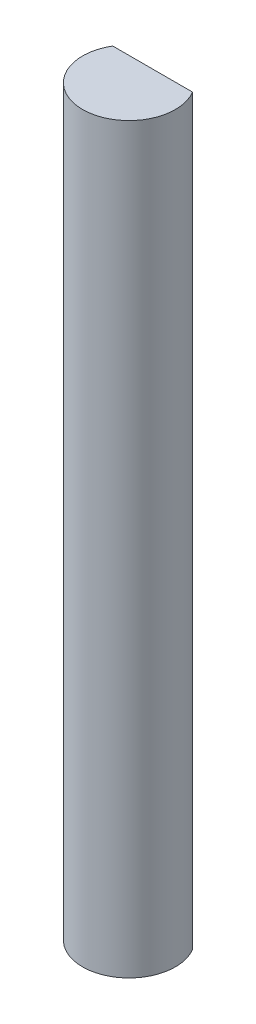
ISO-10303-21;
HEADER;
FILE_DESCRIPTION(('STEP AP214'),'2;1');
FILE_NAME('part.step','',(''),(''),'','','');
FILE_SCHEMA(('AUTOMOTIVE_DESIGN { 1 0 10303 214 1 1 1 1 }'));
ENDSEC;
DATA;
#1=APPLICATION_CONTEXT('core data for automotive mechanical design processes');
#2=APPLICATION_PROTOCOL_DEFINITION('international standard','automotive_design',2000,#1);
#3=PRODUCT_CONTEXT('',#1,'mechanical');
#4=PRODUCT('Part','Part','',(#3));
#5=PRODUCT_RELATED_PRODUCT_CATEGORY('part','',(#4));
#6=PRODUCT_DEFINITION_FORMATION('','',#4);
#7=PRODUCT_DEFINITION_CONTEXT('part definition',#1,'design');
#8=PRODUCT_DEFINITION('design','',#6,#7);
#9=PRODUCT_DEFINITION_SHAPE('','',#8);
#10=(LENGTH_UNIT() NAMED_UNIT(*) SI_UNIT(.MILLI.,.METRE.));
#11=(NAMED_UNIT(*) PLANE_ANGLE_UNIT() SI_UNIT($,.RADIAN.));
#12=(NAMED_UNIT(*) SI_UNIT($,.STERADIAN.) SOLID_ANGLE_UNIT());
#13=UNCERTAINTY_MEASURE_WITH_UNIT(LENGTH_MEASURE(1.E-05),#10,'distance_accuracy_value','');
#14=(GEOMETRIC_REPRESENTATION_CONTEXT(3) GLOBAL_UNCERTAINTY_ASSIGNED_CONTEXT((#13)) GLOBAL_UNIT_ASSIGNED_CONTEXT((#10,
#11,#12)) REPRESENTATION_CONTEXT('',''));
#15=CARTESIAN_POINT('',(0.,0.,0.));
#16=DIRECTION('',(0.,0.,1.));
#17=DIRECTION('',(1.,0.,0.));
#18=AXIS2_PLACEMENT_3D('',#15,#16,#17);
#19=CARTESIAN_POINT('',(0.,50.8,-1.61952887395292));
#20=DIRECTION('',(0.,0.,-1.));
#21=DIRECTION('',(-1.,0.,0.));
#22=AXIS2_PLACEMENT_3D('',#19,#20,#21);
#23=PLANE('',#22);
#24=DIRECTION('',(1.,0.,0.));
#25=VECTOR('',#24,1.);
#26=CARTESIAN_POINT('',(0.,0.,-1.61952887395292));
#27=LINE('',#26,#25);
#28=CARTESIAN_POINT('',(-2.73088835847107,0.,-1.61952887395292));
#29=VERTEX_POINT('',#28);
#30=CARTESIAN_POINT('',(2.73088835847107,0.,-1.61952887395292));
#31=VERTEX_POINT('',#30);
#32=EDGE_CURVE('E70',#29,#31,#27,.T.);
#33=ORIENTED_EDGE('',*,*,#32,.F.);
#34=DIRECTION('',(0.,-1.,0.));
#35=VECTOR('',#34,1.);
#36=CARTESIAN_POINT('',(-2.73088835847107,50.8,-1.61952887395292));
#37=LINE('',#36,#35);
#38=CARTESIAN_POINT('',(-2.73088835847107,50.8,-1.61952887395292));
#39=VERTEX_POINT('',#38);
#40=EDGE_CURVE('E11',#39,#29,#37,.T.);
#41=ORIENTED_EDGE('',*,*,#40,.F.);
#42=DIRECTION('',(1.,0.,0.));
#43=VECTOR('',#42,1.);
#44=CARTESIAN_POINT('',(0.,50.8,-1.61952887395292));
#45=LINE('',#44,#43);
#46=CARTESIAN_POINT('',(2.73088835847107,50.8,-1.61952887395292));
#47=VERTEX_POINT('',#46);
#48=EDGE_CURVE('E71',#39,#47,#45,.T.);
#49=ORIENTED_EDGE('',*,*,#48,.T.);
#50=DIRECTION('',(0.,-1.,0.));
#51=VECTOR('',#50,1.);
#52=CARTESIAN_POINT('',(2.73088835847107,50.8,-1.61952887395292));
#53=LINE('',#52,#51);
#54=EDGE_CURVE('E50',#47,#31,#53,.T.);
#55=ORIENTED_EDGE('',*,*,#54,.T.);
#56=EDGE_LOOP('',(#33,#41,#49,#55));
#57=FACE_BOUND('',#56,.T.);
#58=ADVANCED_FACE('F41',(#57),#23,.T.);
#59=CARTESIAN_POINT('',(0.,50.8,0.));
#60=DIRECTION('',(0.,-1.,0.));
#61=DIRECTION('',(0.,0.,-1.));
#62=AXIS2_PLACEMENT_3D('',#59,#60,#61);
#63=CYLINDRICAL_SURFACE('',#62,3.175);
#64=CARTESIAN_POINT('',(0.,0.,0.));
#65=DIRECTION('',(0.,1.,0.));
#66=DIRECTION('',(0.,0.,1.));
#67=AXIS2_PLACEMENT_3D('',#64,#65,#66);
#68=CIRCLE('',#67,3.175);
#69=EDGE_CURVE('E73',#29,#31,#68,.T.);
#70=ORIENTED_EDGE('',*,*,#69,.T.);
#71=ORIENTED_EDGE('',*,*,#54,.F.);
#72=CARTESIAN_POINT('',(0.,50.8,0.));
#73=DIRECTION('',(0.,1.,0.));
#74=DIRECTION('',(0.,0.,1.));
#75=AXIS2_PLACEMENT_3D('',#72,#73,#74);
#76=CIRCLE('',#75,3.175);
#77=EDGE_CURVE('E57',#39,#47,#76,.T.);
#78=ORIENTED_EDGE('',*,*,#77,.F.);
#79=ORIENTED_EDGE('',*,*,#40,.T.);
#80=EDGE_LOOP('',(#70,#71,#78,#79));
#81=FACE_BOUND('',#80,.T.);
#82=ADVANCED_FACE('F74',(#81),#63,.T.);
#83=CARTESIAN_POINT('',(0.,50.8,0.));
#84=DIRECTION('',(0.,1.,0.));
#85=DIRECTION('',(0.,0.,1.));
#86=AXIS2_PLACEMENT_3D('',#83,#84,#85);
#87=PLANE('',#86);
#88=ORIENTED_EDGE('',*,*,#48,.F.);
#89=ORIENTED_EDGE('',*,*,#77,.T.);
#90=EDGE_LOOP('',(#88,#89));
#91=FACE_BOUND('',#90,.T.);
#92=ADVANCED_FACE('F86',(#91),#87,.T.);
#93=CARTESIAN_POINT('',(0.,0.,0.));
#94=DIRECTION('',(0.,1.,0.));
#95=DIRECTION('',(0.,0.,1.));
#96=AXIS2_PLACEMENT_3D('',#93,#94,#95);
#97=PLANE('',#96);
#98=ORIENTED_EDGE('',*,*,#32,.T.);
#99=ORIENTED_EDGE('',*,*,#69,.F.);
#100=EDGE_LOOP('',(#98,#99));
#101=FACE_BOUND('',#100,.T.);
#102=ADVANCED_FACE('F78',(#101),#97,.F.);
#103=CLOSED_SHELL('',(#58,#82,#92,#102));
#104=MANIFOLD_SOLID_BREP('B2',#103);
#105=ADVANCED_BREP_SHAPE_REPRESENTATION('',(#18,#104),#14);
#106=SHAPE_DEFINITION_REPRESENTATION(#9,#105);
ENDSEC;
END-ISO-10303-21;
